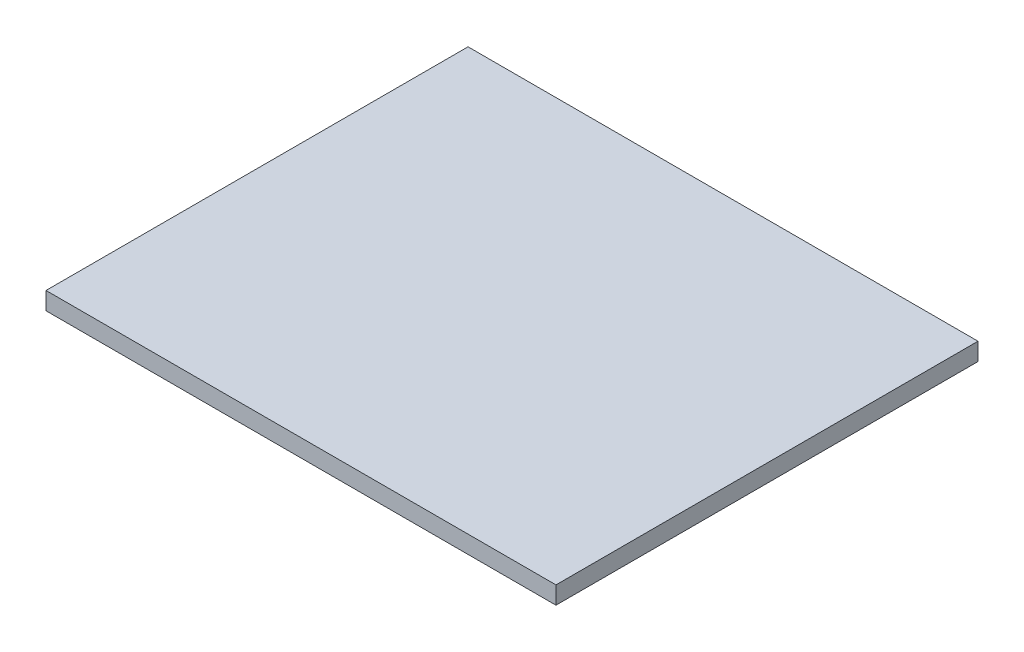
ISO-10303-21;
HEADER;
FILE_DESCRIPTION(('STEP AP214'),'2;1');
FILE_NAME('part.step','',(''),(''),'','','');
FILE_SCHEMA(('AUTOMOTIVE_DESIGN { 1 0 10303 214 1 1 1 1 }'));
ENDSEC;
DATA;
#1=APPLICATION_CONTEXT('core data for automotive mechanical design processes');
#2=APPLICATION_PROTOCOL_DEFINITION('international standard','automotive_design',2000,#1);
#3=PRODUCT_CONTEXT('',#1,'mechanical');
#4=PRODUCT('Part','Part','',(#3));
#5=PRODUCT_RELATED_PRODUCT_CATEGORY('part','',(#4));
#6=PRODUCT_DEFINITION_FORMATION('','',#4);
#7=PRODUCT_DEFINITION_CONTEXT('part definition',#1,'design');
#8=PRODUCT_DEFINITION('design','',#6,#7);
#9=PRODUCT_DEFINITION_SHAPE('','',#8);
#10=(LENGTH_UNIT() NAMED_UNIT(*) SI_UNIT(.MILLI.,.METRE.));
#11=(NAMED_UNIT(*) PLANE_ANGLE_UNIT() SI_UNIT($,.RADIAN.));
#12=(NAMED_UNIT(*) SI_UNIT($,.STERADIAN.) SOLID_ANGLE_UNIT());
#13=UNCERTAINTY_MEASURE_WITH_UNIT(LENGTH_MEASURE(1.E-05),#10,'distance_accuracy_value','');
#14=(GEOMETRIC_REPRESENTATION_CONTEXT(3) GLOBAL_UNCERTAINTY_ASSIGNED_CONTEXT((#13)) GLOBAL_UNIT_ASSIGNED_CONTEXT((#10,
#11,#12)) REPRESENTATION_CONTEXT('',''));
#15=CARTESIAN_POINT('',(0.,0.,0.));
#16=DIRECTION('',(0.,0.,1.));
#17=DIRECTION('',(1.,0.,0.));
#18=AXIS2_PLACEMENT_3D('',#15,#16,#17);
#19=CARTESIAN_POINT('',(29.000000372529,0.,23.9999995529652));
#20=DIRECTION('',(0.,0.,1.));
#21=DIRECTION('',(1.,0.,0.));
#22=AXIS2_PLACEMENT_3D('',#19,#20,#21);
#23=PLANE('',#22);
#24=DIRECTION('',(0.,1.,0.));
#25=VECTOR('',#24,1.);
#26=CARTESIAN_POINT('',(29.000000372529,0.,23.9999995529652));
#27=LINE('',#26,#25);
#28=CARTESIAN_POINT('',(29.000000372529,0.,23.9999995529652));
#29=VERTEX_POINT('',#28);
#30=CARTESIAN_POINT('',(29.000000372529,2.00199999990501,23.9999995529652));
#31=VERTEX_POINT('',#30);
#32=EDGE_CURVE('P0_E37',#29,#31,#27,.T.);
#33=ORIENTED_EDGE('',*,*,#32,.T.);
#34=DIRECTION('',(1.,0.,0.));
#35=VECTOR('',#34,1.);
#36=CARTESIAN_POINT('',(29.000000372529,2.00199999990501,23.9999995529652));
#37=LINE('',#36,#35);
#38=CARTESIAN_POINT('',(-29.000000372529,2.00199999990501,23.9999995529652));
#39=VERTEX_POINT('',#38);
#40=EDGE_CURVE('P0_E74',#39,#31,#37,.T.);
#41=ORIENTED_EDGE('',*,*,#40,.F.);
#42=DIRECTION('',(0.,1.,0.));
#43=VECTOR('',#42,1.);
#44=CARTESIAN_POINT('',(-29.000000372529,0.,23.9999995529652));
#45=LINE('',#44,#43);
#46=CARTESIAN_POINT('',(-29.000000372529,0.,23.9999995529652));
#47=VERTEX_POINT('',#46);
#48=EDGE_CURVE('P0_E11',#47,#39,#45,.T.);
#49=ORIENTED_EDGE('',*,*,#48,.F.);
#50=DIRECTION('',(1.,0.,0.));
#51=VECTOR('',#50,1.);
#52=CARTESIAN_POINT('',(29.000000372529,0.,23.9999995529652));
#53=LINE('',#52,#51);
#54=EDGE_CURVE('P0_E75',#47,#29,#53,.T.);
#55=ORIENTED_EDGE('',*,*,#54,.T.);
#56=EDGE_LOOP('',(#33,#41,#49,#55));
#57=FACE_BOUND('',#56,.T.);
#58=ADVANCED_FACE('P0_F34',(#57),#23,.T.);
#59=CARTESIAN_POINT('',(-29.000000372529,0.,23.9999995529652));
#60=DIRECTION('',(-1.,0.,0.));
#61=DIRECTION('',(0.,0.,1.));
#62=AXIS2_PLACEMENT_3D('',#59,#60,#61);
#63=PLANE('',#62);
#64=ORIENTED_EDGE('',*,*,#48,.T.);
#65=DIRECTION('',(0.,0.,1.));
#66=VECTOR('',#65,1.);
#67=CARTESIAN_POINT('',(-29.000000372529,2.00199999990501,23.9999995529652));
#68=LINE('',#67,#66);
#69=CARTESIAN_POINT('',(-29.000000372529,2.00199999990501,-23.9999995529652));
#70=VERTEX_POINT('',#69);
#71=EDGE_CURVE('P0_E91',#70,#39,#68,.T.);
#72=ORIENTED_EDGE('',*,*,#71,.F.);
#73=DIRECTION('',(0.,1.,0.));
#74=VECTOR('',#73,1.);
#75=CARTESIAN_POINT('',(-29.000000372529,0.,-23.9999995529652));
#76=LINE('',#75,#74);
#77=CARTESIAN_POINT('',(-29.000000372529,0.,-23.9999995529652));
#78=VERTEX_POINT('',#77);
#79=EDGE_CURVE('P0_E42',#78,#70,#76,.T.);
#80=ORIENTED_EDGE('',*,*,#79,.F.);
#81=DIRECTION('',(0.,0.,1.));
#82=VECTOR('',#81,1.);
#83=CARTESIAN_POINT('',(-29.000000372529,0.,23.9999995529652));
#84=LINE('',#83,#82);
#85=EDGE_CURVE('P0_E80',#78,#47,#84,.T.);
#86=ORIENTED_EDGE('',*,*,#85,.T.);
#87=EDGE_LOOP('',(#64,#72,#80,#86));
#88=FACE_BOUND('',#87,.T.);
#89=ADVANCED_FACE('P0_F106',(#88),#63,.T.);
#90=CARTESIAN_POINT('',(-29.000000372529,0.,-23.9999995529652));
#91=DIRECTION('',(0.,0.,-1.));
#92=DIRECTION('',(-1.,0.,0.));
#93=AXIS2_PLACEMENT_3D('',#90,#91,#92);
#94=PLANE('',#93);
#95=ORIENTED_EDGE('',*,*,#79,.T.);
#96=DIRECTION('',(-1.,0.,0.));
#97=VECTOR('',#96,1.);
#98=CARTESIAN_POINT('',(-29.000000372529,2.00199999990501,-23.9999995529652));
#99=LINE('',#98,#97);
#100=CARTESIAN_POINT('',(29.000000372529,2.00199999990501,-23.9999995529652));
#101=VERTEX_POINT('',#100);
#102=EDGE_CURVE('P0_E87',#101,#70,#99,.T.);
#103=ORIENTED_EDGE('',*,*,#102,.F.);
#104=DIRECTION('',(0.,1.,0.));
#105=VECTOR('',#104,1.);
#106=CARTESIAN_POINT('',(29.000000372529,0.,-23.9999995529652));
#107=LINE('',#106,#105);
#108=CARTESIAN_POINT('',(29.000000372529,0.,-23.9999995529652));
#109=VERTEX_POINT('',#108);
#110=EDGE_CURVE('P0_E79',#109,#101,#107,.T.);
#111=ORIENTED_EDGE('',*,*,#110,.F.);
#112=DIRECTION('',(-1.,0.,0.));
#113=VECTOR('',#112,1.);
#114=CARTESIAN_POINT('',(-29.000000372529,0.,-23.9999995529652));
#115=LINE('',#114,#113);
#116=EDGE_CURVE('P0_E99',#109,#78,#115,.T.);
#117=ORIENTED_EDGE('',*,*,#116,.T.);
#118=EDGE_LOOP('',(#95,#103,#111,#117));
#119=FACE_BOUND('',#118,.T.);
#120=ADVANCED_FACE('P0_F103',(#119),#94,.T.);
#121=CARTESIAN_POINT('',(29.000000372529,0.,-23.9999995529652));
#122=DIRECTION('',(1.,0.,0.));
#123=DIRECTION('',(0.,0.,-1.));
#124=AXIS2_PLACEMENT_3D('',#121,#122,#123);
#125=PLANE('',#124);
#126=ORIENTED_EDGE('',*,*,#110,.T.);
#127=DIRECTION('',(0.,0.,-1.));
#128=VECTOR('',#127,1.);
#129=CARTESIAN_POINT('',(29.000000372529,2.00199999990501,-23.9999995529652));
#130=LINE('',#129,#128);
#131=EDGE_CURVE('P0_E82',#31,#101,#130,.T.);
#132=ORIENTED_EDGE('',*,*,#131,.F.);
#133=ORIENTED_EDGE('',*,*,#32,.F.);
#134=DIRECTION('',(0.,0.,-1.));
#135=VECTOR('',#134,1.);
#136=CARTESIAN_POINT('',(29.000000372529,0.,-23.9999995529652));
#137=LINE('',#136,#135);
#138=EDGE_CURVE('P0_E97',#29,#109,#137,.T.);
#139=ORIENTED_EDGE('',*,*,#138,.T.);
#140=EDGE_LOOP('',(#126,#132,#133,#139));
#141=FACE_BOUND('',#140,.T.);
#142=ADVANCED_FACE('P0_F83',(#141),#125,.T.);
#143=CARTESIAN_POINT('',(0.,0.,0.));
#144=DIRECTION('',(0.,-1.,0.));
#145=DIRECTION('',(0.,0.,-1.));
#146=AXIS2_PLACEMENT_3D('',#143,#144,#145);
#147=PLANE('',#146);
#148=ORIENTED_EDGE('',*,*,#54,.F.);
#149=ORIENTED_EDGE('',*,*,#85,.F.);
#150=ORIENTED_EDGE('',*,*,#116,.F.);
#151=ORIENTED_EDGE('',*,*,#138,.F.);
#152=EDGE_LOOP('',(#148,#149,#150,#151));
#153=FACE_BOUND('',#152,.T.);
#154=ADVANCED_FACE('P0_F108',(#153),#147,.T.);
#155=CARTESIAN_POINT('',(0.,2.00199999990501,0.));
#156=DIRECTION('',(0.,-1.,0.));
#157=DIRECTION('',(0.,0.,-1.));
#158=AXIS2_PLACEMENT_3D('',#155,#156,#157);
#159=PLANE('',#158);
#160=ORIENTED_EDGE('',*,*,#40,.T.);
#161=ORIENTED_EDGE('',*,*,#131,.T.);
#162=ORIENTED_EDGE('',*,*,#102,.T.);
#163=ORIENTED_EDGE('',*,*,#71,.T.);
#164=EDGE_LOOP('',(#160,#161,#162,#163));
#165=FACE_BOUND('',#164,.T.);
#166=ADVANCED_FACE('P0_F90',(#165),#159,.F.);
#167=CLOSED_SHELL('',(#58,#89,#120,#142,#154,#166));
#168=MANIFOLD_SOLID_BREP('P0_B2',#167);
#169=CARTESIAN_POINT('',(-9.89949493661162,2.,-9.89949493661117));
#170=DIRECTION('',(0.,-1.,0.));
#171=DIRECTION('',(0.,0.,-1.));
#172=AXIS2_PLACEMENT_3D('',#169,#170,#171);
#173=CYLINDRICAL_SURFACE('',#172,1.7500000000006);
#174=DIRECTION('',(0.,-1.,0.));
#175=VECTOR('',#174,1.);
#176=CARTESIAN_POINT('',(-9.89949493661162,2.,-8.14949493661057));
#177=LINE('',#176,#175);
#178=CARTESIAN_POINT('',(-9.89949493661162,2.,-8.14949493661057));
#179=VERTEX_POINT('',#178);
#180=CARTESIAN_POINT('',(-9.89949493661162,0.,-8.14949493661057));
#181=VERTEX_POINT('',#180);
#182=EDGE_CURVE('P1_E341',#179,#181,#177,.T.);
#183=ORIENTED_EDGE('',*,*,#182,.F.);
#184=CARTESIAN_POINT('',(-9.89949493661162,2.,-9.89949493661117));
#185=DIRECTION('',(0.,1.,0.));
#186=DIRECTION('',(0.,0.,1.));
#187=AXIS2_PLACEMENT_3D('',#184,#185,#186);
#188=CIRCLE('',#187,1.7500000000006);
#189=CARTESIAN_POINT('',(-9.89949493661162,2.,-11.6494949366118));
#190=VERTEX_POINT('',#189);
#191=EDGE_CURVE('P1_E505',#179,#190,#188,.T.);
#192=ORIENTED_EDGE('',*,*,#191,.T.);
#193=DIRECTION('',(0.,-1.,0.));
#194=VECTOR('',#193,1.);
#195=CARTESIAN_POINT('',(-9.89949493661162,2.,-11.6494949366118));
#196=LINE('',#195,#194);
#197=CARTESIAN_POINT('',(-9.89949493661162,0.,-11.6494949366118));
#198=VERTEX_POINT('',#197);
#199=EDGE_CURVE('P1_E340',#190,#198,#196,.T.);
#200=ORIENTED_EDGE('',*,*,#199,.T.);
#201=CARTESIAN_POINT('',(-9.89949493661162,0.,-9.89949493661117));
#202=DIRECTION('',(0.,1.,0.));
#203=DIRECTION('',(0.,0.,1.));
#204=AXIS2_PLACEMENT_3D('',#201,#202,#203);
#205=CIRCLE('',#204,1.7500000000006);
#206=EDGE_CURVE('P1_E537',#181,#198,#205,.T.);
#207=ORIENTED_EDGE('',*,*,#206,.F.);
#208=EDGE_LOOP('',(#183,#192,#200,#207));
#209=FACE_BOUND('',#208,.T.);
#210=ADVANCED_FACE('P1_F17',(#209),#173,.F.);
#211=CARTESIAN_POINT('',(-9.89949493661117,2.,9.89949493661216));
#212=DIRECTION('',(0.,-1.,0.));
#213=DIRECTION('',(0.,0.,-1.));
#214=AXIS2_PLACEMENT_3D('',#211,#212,#213);
#215=CYLINDRICAL_SURFACE('',#214,1.75000000000041);
#216=DIRECTION('',(0.,-1.,0.));
#217=VECTOR('',#216,1.);
#218=CARTESIAN_POINT('',(-9.89949493661117,2.,11.6494949366126));
#219=LINE('',#218,#217);
#220=CARTESIAN_POINT('',(-9.89949493661117,2.,11.6494949366126));
#221=VERTEX_POINT('',#220);
#222=CARTESIAN_POINT('',(-9.89949493661117,0.,11.6494949366126));
#223=VERTEX_POINT('',#222);
#224=EDGE_CURVE('P1_E290',#221,#223,#219,.T.);
#225=ORIENTED_EDGE('',*,*,#224,.F.);
#226=CARTESIAN_POINT('',(-9.89949493661117,2.,9.89949493661216));
#227=DIRECTION('',(0.,1.,0.));
#228=DIRECTION('',(0.,0.,1.));
#229=AXIS2_PLACEMENT_3D('',#226,#227,#228);
#230=CIRCLE('',#229,1.75000000000041);
#231=CARTESIAN_POINT('',(-9.89949493661117,2.,8.14949493661176));
#232=VERTEX_POINT('',#231);
#233=EDGE_CURVE('P1_E502',#221,#232,#230,.T.);
#234=ORIENTED_EDGE('',*,*,#233,.T.);
#235=DIRECTION('',(0.,-1.,0.));
#236=VECTOR('',#235,1.);
#237=CARTESIAN_POINT('',(-9.89949493661117,2.,8.14949493661176));
#238=LINE('',#237,#236);
#239=CARTESIAN_POINT('',(-9.89949493661117,0.,8.14949493661176));
#240=VERTEX_POINT('',#239);
#241=EDGE_CURVE('P1_E437',#232,#240,#238,.T.);
#242=ORIENTED_EDGE('',*,*,#241,.T.);
#243=CARTESIAN_POINT('',(-9.89949493661117,0.,9.89949493661216));
#244=DIRECTION('',(0.,1.,0.));
#245=DIRECTION('',(0.,0.,1.));
#246=AXIS2_PLACEMENT_3D('',#243,#244,#245);
#247=CIRCLE('',#246,1.75000000000041);
#248=EDGE_CURVE('P1_E793',#223,#240,#247,.T.);
#249=ORIENTED_EDGE('',*,*,#248,.F.);
#250=EDGE_LOOP('',(#225,#234,#242,#249));
#251=FACE_BOUND('',#250,.T.);
#252=ADVANCED_FACE('P1_F575',(#251),#215,.F.);
#253=CARTESIAN_POINT('',(9.89949493661216,2.,9.89949493661172));
#254=DIRECTION('',(0.,-1.,0.));
#255=DIRECTION('',(0.,0.,-1.));
#256=AXIS2_PLACEMENT_3D('',#253,#254,#255);
#257=CYLINDRICAL_SURFACE('',#256,1.74999999999986);
#258=DIRECTION('',(0.,-1.,0.));
#259=VECTOR('',#258,1.);
#260=CARTESIAN_POINT('',(9.89949493661216,2.,11.6494949366116));
#261=LINE('',#260,#259);
#262=CARTESIAN_POINT('',(9.89949493661216,2.,11.6494949366116));
#263=VERTEX_POINT('',#262);
#264=CARTESIAN_POINT('',(9.89949493661216,0.,11.6494949366116));
#265=VERTEX_POINT('',#264);
#266=EDGE_CURVE('P1_E316',#263,#265,#261,.T.);
#267=ORIENTED_EDGE('',*,*,#266,.F.);
#268=CARTESIAN_POINT('',(9.89949493661216,2.,9.89949493661172));
#269=DIRECTION('',(0.,1.,0.));
#270=DIRECTION('',(0.,0.,1.));
#271=AXIS2_PLACEMENT_3D('',#268,#269,#270);
#272=CIRCLE('',#271,1.74999999999986);
#273=CARTESIAN_POINT('',(9.89949493661216,2.,8.14949493661186));
#274=VERTEX_POINT('',#273);
#275=EDGE_CURVE('P1_E277',#263,#274,#272,.T.);
#276=ORIENTED_EDGE('',*,*,#275,.T.);
#277=DIRECTION('',(0.,-1.,0.));
#278=VECTOR('',#277,1.);
#279=CARTESIAN_POINT('',(9.89949493661216,2.,8.14949493661186));
#280=LINE('',#279,#278);
#281=CARTESIAN_POINT('',(9.89949493661216,0.,8.14949493661186));
#282=VERTEX_POINT('',#281);
#283=EDGE_CURVE('P1_E328',#274,#282,#280,.T.);
#284=ORIENTED_EDGE('',*,*,#283,.T.);
#285=CARTESIAN_POINT('',(9.89949493661216,0.,9.89949493661172));
#286=DIRECTION('',(0.,1.,0.));
#287=DIRECTION('',(0.,0.,1.));
#288=AXIS2_PLACEMENT_3D('',#285,#286,#287);
#289=CIRCLE('',#288,1.74999999999986);
#290=EDGE_CURVE('P1_E253',#265,#282,#289,.T.);
#291=ORIENTED_EDGE('',*,*,#290,.F.);
#292=EDGE_LOOP('',(#267,#276,#284,#291));
#293=FACE_BOUND('',#292,.T.);
#294=ADVANCED_FACE('P1_F534',(#293),#257,.F.);
#295=CARTESIAN_POINT('',(-20.,2.,15.));
#296=DIRECTION('',(0.,-1.,0.));
#297=DIRECTION('',(0.,0.,-1.));
#298=AXIS2_PLACEMENT_3D('',#295,#296,#297);
#299=CYLINDRICAL_SURFACE('',#298,1.75);
#300=DIRECTION('',(0.,-1.,0.));
#301=VECTOR('',#300,1.);
#302=CARTESIAN_POINT('',(-20.,2.,16.75));
#303=LINE('',#302,#301);
#304=CARTESIAN_POINT('',(-20.,2.,16.75));
#305=VERTEX_POINT('',#304);
#306=CARTESIAN_POINT('',(-20.,0.,16.75));
#307=VERTEX_POINT('',#306);
#308=EDGE_CURVE('P1_E383',#305,#307,#303,.T.);
#309=ORIENTED_EDGE('',*,*,#308,.F.);
#310=CARTESIAN_POINT('',(-20.,2.,15.));
#311=DIRECTION('',(0.,1.,0.));
#312=DIRECTION('',(0.,0.,1.));
#313=AXIS2_PLACEMENT_3D('',#310,#311,#312);
#314=CIRCLE('',#313,1.75);
#315=CARTESIAN_POINT('',(-20.,2.,13.25));
#316=VERTEX_POINT('',#315);
#317=EDGE_CURVE('P1_E499',#305,#316,#314,.T.);
#318=ORIENTED_EDGE('',*,*,#317,.T.);
#319=DIRECTION('',(0.,-1.,0.));
#320=VECTOR('',#319,1.);
#321=CARTESIAN_POINT('',(-20.,2.,13.25));
#322=LINE('',#321,#320);
#323=CARTESIAN_POINT('',(-20.,0.,13.25));
#324=VERTEX_POINT('',#323);
#325=EDGE_CURVE('P1_E398',#316,#324,#322,.T.);
#326=ORIENTED_EDGE('',*,*,#325,.T.);
#327=CARTESIAN_POINT('',(-20.,0.,15.));
#328=DIRECTION('',(0.,1.,0.));
#329=DIRECTION('',(0.,0.,1.));
#330=AXIS2_PLACEMENT_3D('',#327,#328,#329);
#331=CIRCLE('',#330,1.75);
#332=EDGE_CURVE('P1_E21',#307,#324,#331,.T.);
#333=ORIENTED_EDGE('',*,*,#332,.F.);
#334=EDGE_LOOP('',(#309,#318,#326,#333));
#335=FACE_BOUND('',#334,.T.);
#336=ADVANCED_FACE('P1_F574',(#335),#299,.F.);
#337=CARTESIAN_POINT('',(-20.,2.,-15.));
#338=DIRECTION('',(0.,-1.,0.));
#339=DIRECTION('',(0.,0.,-1.));
#340=AXIS2_PLACEMENT_3D('',#337,#338,#339);
#341=CYLINDRICAL_SURFACE('',#340,1.75);
#342=DIRECTION('',(0.,-1.,0.));
#343=VECTOR('',#342,1.);
#344=CARTESIAN_POINT('',(-20.,2.,-13.25));
#345=LINE('',#344,#343);
#346=CARTESIAN_POINT('',(-20.,2.,-13.25));
#347=VERTEX_POINT('',#346);
#348=CARTESIAN_POINT('',(-20.,0.,-13.25));
#349=VERTEX_POINT('',#348);
#350=EDGE_CURVE('P1_E389',#347,#349,#345,.T.);
#351=ORIENTED_EDGE('',*,*,#350,.F.);
#352=CARTESIAN_POINT('',(-20.,2.,-15.));
#353=DIRECTION('',(0.,1.,0.));
#354=DIRECTION('',(0.,0.,1.));
#355=AXIS2_PLACEMENT_3D('',#352,#353,#354);
#356=CIRCLE('',#355,1.75);
#357=CARTESIAN_POINT('',(-20.,2.,-16.75));
#358=VERTEX_POINT('',#357);
#359=EDGE_CURVE('P1_E457',#347,#358,#356,.T.);
#360=ORIENTED_EDGE('',*,*,#359,.T.);
#361=DIRECTION('',(0.,-1.,0.));
#362=VECTOR('',#361,1.);
#363=CARTESIAN_POINT('',(-20.,2.,-16.75));
#364=LINE('',#363,#362);
#365=CARTESIAN_POINT('',(-20.,0.,-16.75));
#366=VERTEX_POINT('',#365);
#367=EDGE_CURVE('P1_E410',#358,#366,#364,.T.);
#368=ORIENTED_EDGE('',*,*,#367,.T.);
#369=CARTESIAN_POINT('',(-20.,0.,-15.));
#370=DIRECTION('',(0.,1.,0.));
#371=DIRECTION('',(0.,0.,1.));
#372=AXIS2_PLACEMENT_3D('',#369,#370,#371);
#373=CIRCLE('',#372,1.75);
#374=EDGE_CURVE('P1_E411',#349,#366,#373,.T.);
#375=ORIENTED_EDGE('',*,*,#374,.F.);
#376=EDGE_LOOP('',(#351,#360,#368,#375));
#377=FACE_BOUND('',#376,.T.);
#378=ADVANCED_FACE('P1_F625',(#377),#341,.F.);
#379=CARTESIAN_POINT('',(9.89949493661172,2.,-9.89949493661161));
#380=DIRECTION('',(0.,-1.,0.));
#381=DIRECTION('',(0.,0.,-1.));
#382=AXIS2_PLACEMENT_3D('',#379,#380,#381);
#383=CYLINDRICAL_SURFACE('',#382,1.75);
#384=DIRECTION('',(0.,-1.,0.));
#385=VECTOR('',#384,1.);
#386=CARTESIAN_POINT('',(9.89949493661172,2.,-8.14949493661162));
#387=LINE('',#386,#385);
#388=CARTESIAN_POINT('',(9.89949493661172,2.,-8.14949493661161));
#389=VERTEX_POINT('',#388);
#390=CARTESIAN_POINT('',(9.89949493661172,0.,-8.14949493661161));
#391=VERTEX_POINT('',#390);
#392=EDGE_CURVE('P1_E360',#389,#391,#387,.T.);
#393=ORIENTED_EDGE('',*,*,#392,.F.);
#394=CARTESIAN_POINT('',(9.89949493661172,2.,-9.89949493661161));
#395=DIRECTION('',(0.,1.,0.));
#396=DIRECTION('',(0.,0.,1.));
#397=AXIS2_PLACEMENT_3D('',#394,#395,#396);
#398=CIRCLE('',#397,1.75);
#399=CARTESIAN_POINT('',(9.89949493661172,2.,-11.6494949366116));
#400=VERTEX_POINT('',#399);
#401=EDGE_CURVE('P1_E454',#389,#400,#398,.T.);
#402=ORIENTED_EDGE('',*,*,#401,.T.);
#403=DIRECTION('',(0.,-1.,0.));
#404=VECTOR('',#403,1.);
#405=CARTESIAN_POINT('',(9.89949493661172,2.,-11.6494949366116));
#406=LINE('',#405,#404);
#407=CARTESIAN_POINT('',(9.89949493661172,0.,-11.6494949366116));
#408=VERTEX_POINT('',#407);
#409=EDGE_CURVE('P1_E375',#400,#408,#406,.T.);
#410=ORIENTED_EDGE('',*,*,#409,.T.);
#411=CARTESIAN_POINT('',(9.89949493661172,0.,-9.89949493661161));
#412=DIRECTION('',(0.,1.,0.));
#413=DIRECTION('',(0.,0.,1.));
#414=AXIS2_PLACEMENT_3D('',#411,#412,#413);
#415=CIRCLE('',#414,1.75);
#416=EDGE_CURVE('P1_E293',#391,#408,#415,.T.);
#417=ORIENTED_EDGE('',*,*,#416,.F.);
#418=EDGE_LOOP('',(#393,#402,#410,#417));
#419=FACE_BOUND('',#418,.T.);
#420=ADVANCED_FACE('P1_F630',(#419),#383,.F.);
#421=CARTESIAN_POINT('',(20.,2.,15.));
#422=DIRECTION('',(0.,-1.,0.));
#423=DIRECTION('',(0.,0.,-1.));
#424=AXIS2_PLACEMENT_3D('',#421,#422,#423);
#425=CYLINDRICAL_SURFACE('',#424,1.75);
#426=DIRECTION('',(0.,-1.,0.));
#427=VECTOR('',#426,1.);
#428=CARTESIAN_POINT('',(20.,2.,16.75));
#429=LINE('',#428,#427);
#430=CARTESIAN_POINT('',(20.,2.,16.75));
#431=VERTEX_POINT('',#430);
#432=CARTESIAN_POINT('',(20.,0.,16.75));
#433=VERTEX_POINT('',#432);
#434=EDGE_CURVE('P1_E804',#431,#433,#429,.T.);
#435=ORIENTED_EDGE('',*,*,#434,.F.);
#436=CARTESIAN_POINT('',(20.,2.,15.));
#437=DIRECTION('',(0.,1.,0.));
#438=DIRECTION('',(0.,0.,1.));
#439=AXIS2_PLACEMENT_3D('',#436,#437,#438);
#440=CIRCLE('',#439,1.75);
#441=CARTESIAN_POINT('',(20.,2.,13.25));
#442=VERTEX_POINT('',#441);
#443=EDGE_CURVE('P1_E224',#431,#442,#440,.T.);
#444=ORIENTED_EDGE('',*,*,#443,.T.);
#445=DIRECTION('',(0.,-1.,0.));
#446=VECTOR('',#445,1.);
#447=CARTESIAN_POINT('',(20.,2.,13.25));
#448=LINE('',#447,#446);
#449=CARTESIAN_POINT('',(20.,0.,13.25));
#450=VERTEX_POINT('',#449);
#451=EDGE_CURVE('P1_E238',#442,#450,#448,.T.);
#452=ORIENTED_EDGE('',*,*,#451,.T.);
#453=CARTESIAN_POINT('',(20.,0.,15.));
#454=DIRECTION('',(0.,1.,0.));
#455=DIRECTION('',(0.,0.,1.));
#456=AXIS2_PLACEMENT_3D('',#453,#454,#455);
#457=CIRCLE('',#456,1.75);
#458=EDGE_CURVE('P1_E269',#433,#450,#457,.T.);
#459=ORIENTED_EDGE('',*,*,#458,.F.);
#460=EDGE_LOOP('',(#435,#444,#452,#459));
#461=FACE_BOUND('',#460,.T.);
#462=ADVANCED_FACE('P1_F549',(#461),#425,.F.);
#463=CARTESIAN_POINT('',(20.,2.,-15.));
#464=DIRECTION('',(0.,-1.,0.));
#465=DIRECTION('',(0.,0.,-1.));
#466=AXIS2_PLACEMENT_3D('',#463,#464,#465);
#467=CYLINDRICAL_SURFACE('',#466,1.75);
#468=DIRECTION('',(0.,-1.,0.));
#469=VECTOR('',#468,1.);
#470=CARTESIAN_POINT('',(20.,2.,-13.25));
#471=LINE('',#470,#469);
#472=CARTESIAN_POINT('',(20.,2.,-13.25));
#473=VERTEX_POINT('',#472);
#474=CARTESIAN_POINT('',(20.,0.,-13.25));
#475=VERTEX_POINT('',#474);
#476=EDGE_CURVE('P1_E219',#473,#475,#471,.T.);
#477=ORIENTED_EDGE('',*,*,#476,.F.);
#478=CARTESIAN_POINT('',(20.,2.,-15.));
#479=DIRECTION('',(0.,1.,0.));
#480=DIRECTION('',(0.,0.,1.));
#481=AXIS2_PLACEMENT_3D('',#478,#479,#480);
#482=CIRCLE('',#481,1.75);
#483=CARTESIAN_POINT('',(20.,2.,-16.75));
#484=VERTEX_POINT('',#483);
#485=EDGE_CURVE('P1_E213',#473,#484,#482,.T.);
#486=ORIENTED_EDGE('',*,*,#485,.T.);
#487=DIRECTION('',(0.,-1.,0.));
#488=VECTOR('',#487,1.);
#489=CARTESIAN_POINT('',(20.,2.,-16.75));
#490=LINE('',#489,#488);
#491=CARTESIAN_POINT('',(20.,0.,-16.75));
#492=VERTEX_POINT('',#491);
#493=EDGE_CURVE('P1_E216',#484,#492,#490,.T.);
#494=ORIENTED_EDGE('',*,*,#493,.T.);
#495=CARTESIAN_POINT('',(20.,0.,-15.));
#496=DIRECTION('',(0.,1.,0.));
#497=DIRECTION('',(0.,0.,1.));
#498=AXIS2_PLACEMENT_3D('',#495,#496,#497);
#499=CIRCLE('',#498,1.75);
#500=EDGE_CURVE('P1_E296',#475,#492,#499,.T.);
#501=ORIENTED_EDGE('',*,*,#500,.F.);
#502=EDGE_LOOP('',(#477,#486,#494,#501));
#503=FACE_BOUND('',#502,.T.);
#504=ADVANCED_FACE('P1_F215',(#503),#467,.F.);
#505=CARTESIAN_POINT('',(0.,2.,0.));
#506=DIRECTION('',(0.,-1.,0.));
#507=DIRECTION('',(0.,0.,-1.));
#508=AXIS2_PLACEMENT_3D('',#505,#506,#507);
#509=CYLINDRICAL_SURFACE('',#508,11.);
#510=DIRECTION('',(0.,-1.,0.));
#511=VECTOR('',#510,1.);
#512=CARTESIAN_POINT('',(0.,2.,11.));
#513=LINE('',#512,#511);
#514=CARTESIAN_POINT('',(0.,2.,11.));
#515=VERTEX_POINT('',#514);
#516=CARTESIAN_POINT('',(0.,0.,11.));
#517=VERTEX_POINT('',#516);
#518=EDGE_CURVE('P1_E424',#515,#517,#513,.T.);
#519=ORIENTED_EDGE('',*,*,#518,.F.);
#520=CARTESIAN_POINT('',(0.,2.,0.));
#521=DIRECTION('',(0.,1.,0.));
#522=DIRECTION('',(0.,0.,1.));
#523=AXIS2_PLACEMENT_3D('',#520,#521,#522);
#524=CIRCLE('',#523,11.);
#525=CARTESIAN_POINT('',(0.,2.,-11.));
#526=VERTEX_POINT('',#525);
#527=EDGE_CURVE('P1_E225',#515,#526,#524,.T.);
#528=ORIENTED_EDGE('',*,*,#527,.T.);
#529=DIRECTION('',(0.,-1.,0.));
#530=VECTOR('',#529,1.);
#531=CARTESIAN_POINT('',(0.,2.,-11.));
#532=LINE('',#531,#530);
#533=CARTESIAN_POINT('',(0.,0.,-11.));
#534=VERTEX_POINT('',#533);
#535=EDGE_CURVE('P1_E471',#526,#534,#532,.T.);
#536=ORIENTED_EDGE('',*,*,#535,.T.);
#537=CARTESIAN_POINT('',(0.,0.,0.));
#538=DIRECTION('',(0.,1.,0.));
#539=DIRECTION('',(0.,0.,1.));
#540=AXIS2_PLACEMENT_3D('',#537,#538,#539);
#541=CIRCLE('',#540,11.);
#542=EDGE_CURVE('P1_E313',#517,#534,#541,.T.);
#543=ORIENTED_EDGE('',*,*,#542,.F.);
#544=EDGE_LOOP('',(#519,#528,#536,#543));
#545=FACE_BOUND('',#544,.T.);
#546=ADVANCED_FACE('P1_F476',(#545),#509,.F.);
#547=CARTESIAN_POINT('',(25.,2.,-20.));
#548=DIRECTION('',(0.,0.,1.));
#549=DIRECTION('',(1.,0.,0.));
#550=AXIS2_PLACEMENT_3D('',#547,#548,#549);
#551=PLANE('',#550);
#552=DIRECTION('',(-1.,0.,0.));
#553=VECTOR('',#552,1.);
#554=CARTESIAN_POINT('',(25.,0.,-20.));
#555=LINE('',#554,#553);
#556=CARTESIAN_POINT('',(25.,0.,-20.));
#557=VERTEX_POINT('',#556);
#558=CARTESIAN_POINT('',(-25.,0.,-20.));
#559=VERTEX_POINT('',#558);
#560=EDGE_CURVE('P1_E283',#557,#559,#555,.T.);
#561=ORIENTED_EDGE('',*,*,#560,.T.);
#562=DIRECTION('',(0.,-1.,0.));
#563=VECTOR('',#562,1.);
#564=CARTESIAN_POINT('',(-25.,2.,-20.));
#565=LINE('',#564,#563);
#566=CARTESIAN_POINT('',(-25.,2.,-20.));
#567=VERTEX_POINT('',#566);
#568=EDGE_CURVE('P1_E272',#567,#559,#565,.T.);
#569=ORIENTED_EDGE('',*,*,#568,.F.);
#570=DIRECTION('',(-1.,0.,0.));
#571=VECTOR('',#570,1.);
#572=CARTESIAN_POINT('',(25.,2.,-20.));
#573=LINE('',#572,#571);
#574=CARTESIAN_POINT('',(25.,2.,-20.));
#575=VERTEX_POINT('',#574);
#576=EDGE_CURVE('P1_E475',#575,#567,#573,.T.);
#577=ORIENTED_EDGE('',*,*,#576,.F.);
#578=DIRECTION('',(0.,-1.,0.));
#579=VECTOR('',#578,1.);
#580=CARTESIAN_POINT('',(25.,2.,-20.));
#581=LINE('',#580,#579);
#582=EDGE_CURVE('P1_E10',#575,#557,#581,.T.);
#583=ORIENTED_EDGE('',*,*,#582,.T.);
#584=EDGE_LOOP('',(#561,#569,#577,#583));
#585=FACE_BOUND('',#584,.T.);
#586=ADVANCED_FACE('P1_F667',(#585),#551,.F.);
#587=CARTESIAN_POINT('',(25.,2.,-20.));
#588=DIRECTION('',(-1.,0.,0.));
#589=DIRECTION('',(0.,1.,0.));
#590=AXIS2_PLACEMENT_3D('',#587,#588,#589);
#591=PLANE('',#590);
#592=DIRECTION('',(0.,0.,-1.));
#593=VECTOR('',#592,1.);
#594=CARTESIAN_POINT('',(25.,0.,-20.));
#595=LINE('',#594,#593);
#596=CARTESIAN_POINT('',(25.,0.,20.));
#597=VERTEX_POINT('',#596);
#598=EDGE_CURVE('P1_E288',#597,#557,#595,.T.);
#599=ORIENTED_EDGE('',*,*,#598,.T.);
#600=ORIENTED_EDGE('',*,*,#582,.F.);
#601=DIRECTION('',(0.,0.,-1.));
#602=VECTOR('',#601,1.);
#603=CARTESIAN_POINT('',(25.,2.,-20.));
#604=LINE('',#603,#602);
#605=CARTESIAN_POINT('',(25.,2.,20.));
#606=VERTEX_POINT('',#605);
#607=EDGE_CURVE('P1_E881',#606,#575,#604,.T.);
#608=ORIENTED_EDGE('',*,*,#607,.F.);
#609=DIRECTION('',(0.,-1.,0.));
#610=VECTOR('',#609,1.);
#611=CARTESIAN_POINT('',(25.,2.,20.));
#612=LINE('',#611,#610);
#613=EDGE_CURVE('P1_E29',#606,#597,#612,.T.);
#614=ORIENTED_EDGE('',*,*,#613,.T.);
#615=EDGE_LOOP('',(#599,#600,#608,#614));
#616=FACE_BOUND('',#615,.T.);
#617=ADVANCED_FACE('P1_F675',(#616),#591,.F.);
#618=CARTESIAN_POINT('',(25.,2.,20.));
#619=DIRECTION('',(0.,0.,-1.));
#620=DIRECTION('',(-1.,0.,0.));
#621=AXIS2_PLACEMENT_3D('',#618,#619,#620);
#622=PLANE('',#621);
#623=DIRECTION('',(1.,0.,0.));
#624=VECTOR('',#623,1.);
#625=CARTESIAN_POINT('',(25.,0.,20.));
#626=LINE('',#625,#624);
#627=CARTESIAN_POINT('',(-25.,0.,20.));
#628=VERTEX_POINT('',#627);
#629=EDGE_CURVE('P1_E796',#628,#597,#626,.T.);
#630=ORIENTED_EDGE('',*,*,#629,.T.);
#631=ORIENTED_EDGE('',*,*,#613,.F.);
#632=DIRECTION('',(1.,0.,0.));
#633=VECTOR('',#632,1.);
#634=CARTESIAN_POINT('',(25.,2.,20.));
#635=LINE('',#634,#633);
#636=CARTESIAN_POINT('',(-25.,2.,20.));
#637=VERTEX_POINT('',#636);
#638=EDGE_CURVE('P1_E342',#637,#606,#635,.T.);
#639=ORIENTED_EDGE('',*,*,#638,.F.);
#640=DIRECTION('',(0.,-1.,0.));
#641=VECTOR('',#640,1.);
#642=CARTESIAN_POINT('',(-25.,2.,20.));
#643=LINE('',#642,#641);
#644=EDGE_CURVE('P1_E276',#637,#628,#643,.T.);
#645=ORIENTED_EDGE('',*,*,#644,.T.);
#646=EDGE_LOOP('',(#630,#631,#639,#645));
#647=FACE_BOUND('',#646,.T.);
#648=ADVANCED_FACE('P1_F684',(#647),#622,.F.);
#649=CARTESIAN_POINT('',(-25.,2.,-20.));
#650=DIRECTION('',(1.,0.,0.));
#651=DIRECTION('',(0.,0.,-1.));
#652=AXIS2_PLACEMENT_3D('',#649,#650,#651);
#653=PLANE('',#652);
#654=DIRECTION('',(0.,0.,1.));
#655=VECTOR('',#654,1.);
#656=CARTESIAN_POINT('',(-25.,0.,-20.));
#657=LINE('',#656,#655);
#658=EDGE_CURVE('P1_E289',#559,#628,#657,.T.);
#659=ORIENTED_EDGE('',*,*,#658,.T.);
#660=ORIENTED_EDGE('',*,*,#644,.F.);
#661=DIRECTION('',(0.,0.,1.));
#662=VECTOR('',#661,1.);
#663=CARTESIAN_POINT('',(-25.,2.,-20.));
#664=LINE('',#663,#662);
#665=EDGE_CURVE('P1_E490',#567,#637,#664,.T.);
#666=ORIENTED_EDGE('',*,*,#665,.F.);
#667=ORIENTED_EDGE('',*,*,#568,.T.);
#668=EDGE_LOOP('',(#659,#660,#666,#667));
#669=FACE_BOUND('',#668,.T.);
#670=ADVANCED_FACE('P1_F692',(#669),#653,.F.);
#671=CARTESIAN_POINT('',(0.,0.,0.));
#672=DIRECTION('',(0.,-1.,0.));
#673=DIRECTION('',(0.,0.,-1.));
#674=AXIS2_PLACEMENT_3D('',#671,#672,#673);
#675=PLANE('',#674);
#676=CARTESIAN_POINT('',(-9.89949493661162,0.,-9.89949493661117));
#677=DIRECTION('',(0.,1.,0.));
#678=DIRECTION('',(0.,0.,1.));
#679=AXIS2_PLACEMENT_3D('',#676,#677,#678);
#680=CIRCLE('',#679,1.7500000000006);
#681=EDGE_CURVE('P1_E336',#198,#181,#680,.T.);
#682=ORIENTED_EDGE('',*,*,#681,.T.);
#683=ORIENTED_EDGE('',*,*,#206,.T.);
#684=EDGE_LOOP('',(#682,#683));
#685=FACE_BOUND('',#684,.T.);
#686=CARTESIAN_POINT('',(9.89949493661216,0.,9.89949493661172));
#687=DIRECTION('',(0.,1.,0.));
#688=DIRECTION('',(0.,0.,1.));
#689=AXIS2_PLACEMENT_3D('',#686,#687,#688);
#690=CIRCLE('',#689,1.74999999999986);
#691=EDGE_CURVE('P1_E320',#282,#265,#690,.T.);
#692=ORIENTED_EDGE('',*,*,#691,.T.);
#693=ORIENTED_EDGE('',*,*,#290,.T.);
#694=EDGE_LOOP('',(#692,#693));
#695=FACE_BOUND('',#694,.T.);
#696=CARTESIAN_POINT('',(-20.,0.,-15.));
#697=DIRECTION('',(0.,1.,0.));
#698=DIRECTION('',(0.,0.,1.));
#699=AXIS2_PLACEMENT_3D('',#696,#697,#698);
#700=CIRCLE('',#699,1.75);
#701=EDGE_CURVE('P1_E438',#366,#349,#700,.T.);
#702=ORIENTED_EDGE('',*,*,#701,.T.);
#703=ORIENTED_EDGE('',*,*,#374,.T.);
#704=EDGE_LOOP('',(#702,#703));
#705=FACE_BOUND('',#704,.T.);
#706=CARTESIAN_POINT('',(20.,0.,15.));
#707=DIRECTION('',(0.,1.,0.));
#708=DIRECTION('',(0.,0.,1.));
#709=AXIS2_PLACEMENT_3D('',#706,#707,#708);
#710=CIRCLE('',#709,1.75);
#711=EDGE_CURVE('P1_E248',#450,#433,#710,.T.);
#712=ORIENTED_EDGE('',*,*,#711,.T.);
#713=ORIENTED_EDGE('',*,*,#458,.T.);
#714=EDGE_LOOP('',(#712,#713));
#715=FACE_BOUND('',#714,.T.);
#716=CARTESIAN_POINT('',(0.,0.,0.));
#717=DIRECTION('',(0.,1.,0.));
#718=DIRECTION('',(0.,0.,1.));
#719=AXIS2_PLACEMENT_3D('',#716,#717,#718);
#720=CIRCLE('',#719,11.);
#721=EDGE_CURVE('P1_E430',#534,#517,#720,.T.);
#722=ORIENTED_EDGE('',*,*,#721,.T.);
#723=ORIENTED_EDGE('',*,*,#542,.T.);
#724=EDGE_LOOP('',(#722,#723));
#725=FACE_BOUND('',#724,.T.);
#726=CARTESIAN_POINT('',(20.,0.,-15.));
#727=DIRECTION('',(0.,1.,0.));
#728=DIRECTION('',(0.,0.,1.));
#729=AXIS2_PLACEMENT_3D('',#726,#727,#728);
#730=CIRCLE('',#729,1.75);
#731=EDGE_CURVE('P1_E231',#492,#475,#730,.T.);
#732=ORIENTED_EDGE('',*,*,#731,.T.);
#733=ORIENTED_EDGE('',*,*,#500,.T.);
#734=EDGE_LOOP('',(#732,#733));
#735=FACE_BOUND('',#734,.T.);
#736=CARTESIAN_POINT('',(9.89949493661172,0.,-9.89949493661161));
#737=DIRECTION('',(0.,1.,0.));
#738=DIRECTION('',(0.,0.,1.));
#739=AXIS2_PLACEMENT_3D('',#736,#737,#738);
#740=CIRCLE('',#739,1.75);
#741=EDGE_CURVE('P1_E365',#408,#391,#740,.T.);
#742=ORIENTED_EDGE('',*,*,#741,.T.);
#743=ORIENTED_EDGE('',*,*,#416,.T.);
#744=EDGE_LOOP('',(#742,#743));
#745=FACE_BOUND('',#744,.T.);
#746=CARTESIAN_POINT('',(-20.,0.,15.));
#747=DIRECTION('',(0.,1.,0.));
#748=DIRECTION('',(0.,0.,1.));
#749=AXIS2_PLACEMENT_3D('',#746,#747,#748);
#750=CIRCLE('',#749,1.75);
#751=EDGE_CURVE('P1_E388',#324,#307,#750,.T.);
#752=ORIENTED_EDGE('',*,*,#751,.T.);
#753=ORIENTED_EDGE('',*,*,#332,.T.);
#754=EDGE_LOOP('',(#752,#753));
#755=FACE_BOUND('',#754,.T.);
#756=CARTESIAN_POINT('',(-9.89949493661117,0.,9.89949493661216));
#757=DIRECTION('',(0.,1.,0.));
#758=DIRECTION('',(0.,0.,1.));
#759=AXIS2_PLACEMENT_3D('',#756,#757,#758);
#760=CIRCLE('',#759,1.75000000000041);
#761=EDGE_CURVE('P1_E433',#240,#223,#760,.T.);
#762=ORIENTED_EDGE('',*,*,#761,.T.);
#763=ORIENTED_EDGE('',*,*,#248,.T.);
#764=EDGE_LOOP('',(#762,#763));
#765=FACE_BOUND('',#764,.T.);
#766=ORIENTED_EDGE('',*,*,#658,.F.);
#767=ORIENTED_EDGE('',*,*,#560,.F.);
#768=ORIENTED_EDGE('',*,*,#598,.F.);
#769=ORIENTED_EDGE('',*,*,#629,.F.);
#770=EDGE_LOOP('',(#766,#767,#768,#769));
#771=FACE_BOUND('',#770,.T.);
#772=ADVANCED_FACE('P1_F481',(#685,#695,#705,#715,#725,#735,#745,#755,#765,#771),#675,.T.);
#773=CARTESIAN_POINT('',(0.,2.,0.));
#774=DIRECTION('',(0.,-1.,0.));
#775=DIRECTION('',(0.,0.,-1.));
#776=AXIS2_PLACEMENT_3D('',#773,#774,#775);
#777=PLANE('',#776);
#778=CARTESIAN_POINT('',(-9.89949493661162,2.,-9.89949493661117));
#779=DIRECTION('',(0.,1.,0.));
#780=DIRECTION('',(0.,0.,1.));
#781=AXIS2_PLACEMENT_3D('',#778,#779,#780);
#782=CIRCLE('',#781,1.7500000000006);
#783=EDGE_CURVE('P1_E352',#190,#179,#782,.T.);
#784=ORIENTED_EDGE('',*,*,#783,.F.);
#785=ORIENTED_EDGE('',*,*,#191,.F.);
#786=EDGE_LOOP('',(#784,#785));
#787=FACE_BOUND('',#786,.T.);
#788=CARTESIAN_POINT('',(-9.89949493661117,2.,9.89949493661216));
#789=DIRECTION('',(0.,1.,0.));
#790=DIRECTION('',(0.,0.,1.));
#791=AXIS2_PLACEMENT_3D('',#788,#789,#790);
#792=CIRCLE('',#791,1.75000000000041);
#793=EDGE_CURVE('P1_E447',#232,#221,#792,.T.);
#794=ORIENTED_EDGE('',*,*,#793,.F.);
#795=ORIENTED_EDGE('',*,*,#233,.F.);
#796=EDGE_LOOP('',(#794,#795));
#797=FACE_BOUND('',#796,.T.);
#798=CARTESIAN_POINT('',(9.89949493661216,2.,9.89949493661172));
#799=DIRECTION('',(0.,1.,0.));
#800=DIRECTION('',(0.,0.,1.));
#801=AXIS2_PLACEMENT_3D('',#798,#799,#800);
#802=CIRCLE('',#801,1.74999999999986);
#803=EDGE_CURVE('P1_E256',#274,#263,#802,.T.);
#804=ORIENTED_EDGE('',*,*,#803,.F.);
#805=ORIENTED_EDGE('',*,*,#275,.F.);
#806=EDGE_LOOP('',(#804,#805));
#807=FACE_BOUND('',#806,.T.);
#808=CARTESIAN_POINT('',(-20.,2.,15.));
#809=DIRECTION('',(0.,1.,0.));
#810=DIRECTION('',(0.,0.,1.));
#811=AXIS2_PLACEMENT_3D('',#808,#809,#810);
#812=CIRCLE('',#811,1.75);
#813=EDGE_CURVE('P1_E333',#316,#305,#812,.T.);
#814=ORIENTED_EDGE('',*,*,#813,.F.);
#815=ORIENTED_EDGE('',*,*,#317,.F.);
#816=EDGE_LOOP('',(#814,#815));
#817=FACE_BOUND('',#816,.T.);
#818=CARTESIAN_POINT('',(-20.,2.,-15.));
#819=DIRECTION('',(0.,1.,0.));
#820=DIRECTION('',(0.,0.,1.));
#821=AXIS2_PLACEMENT_3D('',#818,#819,#820);
#822=CIRCLE('',#821,1.75);
#823=EDGE_CURVE('P1_E403',#358,#347,#822,.T.);
#824=ORIENTED_EDGE('',*,*,#823,.F.);
#825=ORIENTED_EDGE('',*,*,#359,.F.);
#826=EDGE_LOOP('',(#824,#825));
#827=FACE_BOUND('',#826,.T.);
#828=CARTESIAN_POINT('',(9.89949493661172,2.,-9.89949493661161));
#829=DIRECTION('',(0.,1.,0.));
#830=DIRECTION('',(0.,0.,1.));
#831=AXIS2_PLACEMENT_3D('',#828,#829,#830);
#832=CIRCLE('',#831,1.75);
#833=EDGE_CURVE('P1_E366',#400,#389,#832,.T.);
#834=ORIENTED_EDGE('',*,*,#833,.F.);
#835=ORIENTED_EDGE('',*,*,#401,.F.);
#836=EDGE_LOOP('',(#834,#835));
#837=FACE_BOUND('',#836,.T.);
#838=CARTESIAN_POINT('',(20.,2.,15.));
#839=DIRECTION('',(0.,1.,0.));
#840=DIRECTION('',(0.,0.,1.));
#841=AXIS2_PLACEMENT_3D('',#838,#839,#840);
#842=CIRCLE('',#841,1.75);
#843=EDGE_CURVE('P1_E381',#442,#431,#842,.T.);
#844=ORIENTED_EDGE('',*,*,#843,.F.);
#845=ORIENTED_EDGE('',*,*,#443,.F.);
#846=EDGE_LOOP('',(#844,#845));
#847=FACE_BOUND('',#846,.T.);
#848=CARTESIAN_POINT('',(20.,2.,-15.));
#849=DIRECTION('',(0.,1.,0.));
#850=DIRECTION('',(0.,0.,1.));
#851=AXIS2_PLACEMENT_3D('',#848,#849,#850);
#852=CIRCLE('',#851,1.75);
#853=EDGE_CURVE('P1_E229',#484,#473,#852,.T.);
#854=ORIENTED_EDGE('',*,*,#853,.F.);
#855=ORIENTED_EDGE('',*,*,#485,.F.);
#856=EDGE_LOOP('',(#854,#855));
#857=FACE_BOUND('',#856,.T.);
#858=CARTESIAN_POINT('',(0.,2.,0.));
#859=DIRECTION('',(0.,1.,0.));
#860=DIRECTION('',(0.,0.,1.));
#861=AXIS2_PLACEMENT_3D('',#858,#859,#860);
#862=CIRCLE('',#861,11.);
#863=EDGE_CURVE('P1_E233',#526,#515,#862,.T.);
#864=ORIENTED_EDGE('',*,*,#863,.F.);
#865=ORIENTED_EDGE('',*,*,#527,.F.);
#866=EDGE_LOOP('',(#864,#865));
#867=FACE_BOUND('',#866,.T.);
#868=ORIENTED_EDGE('',*,*,#665,.T.);
#869=ORIENTED_EDGE('',*,*,#638,.T.);
#870=ORIENTED_EDGE('',*,*,#607,.T.);
#871=ORIENTED_EDGE('',*,*,#576,.T.);
#872=EDGE_LOOP('',(#868,#869,#870,#871));
#873=FACE_BOUND('',#872,.T.);
#874=ADVANCED_FACE('P1_F235',(#787,#797,#807,#817,#827,#837,#847,#857,#867,#873),#777,.F.);
#875=CARTESIAN_POINT('',(0.,2.,0.));
#876=DIRECTION('',(0.,-1.,0.));
#877=DIRECTION('',(0.,0.,-1.));
#878=AXIS2_PLACEMENT_3D('',#875,#876,#877);
#879=CYLINDRICAL_SURFACE('',#878,11.);
#880=ORIENTED_EDGE('',*,*,#863,.T.);
#881=ORIENTED_EDGE('',*,*,#518,.T.);
#882=ORIENTED_EDGE('',*,*,#721,.F.);
#883=ORIENTED_EDGE('',*,*,#535,.F.);
#884=EDGE_LOOP('',(#880,#881,#882,#883));
#885=FACE_BOUND('',#884,.T.);
#886=ADVANCED_FACE('P1_F467',(#885),#879,.F.);
#887=CARTESIAN_POINT('',(20.,2.,-15.));
#888=DIRECTION('',(0.,-1.,0.));
#889=DIRECTION('',(0.,0.,-1.));
#890=AXIS2_PLACEMENT_3D('',#887,#888,#889);
#891=CYLINDRICAL_SURFACE('',#890,1.75);
#892=ORIENTED_EDGE('',*,*,#853,.T.);
#893=ORIENTED_EDGE('',*,*,#476,.T.);
#894=ORIENTED_EDGE('',*,*,#731,.F.);
#895=ORIENTED_EDGE('',*,*,#493,.F.);
#896=EDGE_LOOP('',(#892,#893,#894,#895));
#897=FACE_BOUND('',#896,.T.);
#898=ADVANCED_FACE('P1_F228',(#897),#891,.F.);
#899=CARTESIAN_POINT('',(20.,2.,15.));
#900=DIRECTION('',(0.,-1.,0.));
#901=DIRECTION('',(0.,0.,-1.));
#902=AXIS2_PLACEMENT_3D('',#899,#900,#901);
#903=CYLINDRICAL_SURFACE('',#902,1.75);
#904=ORIENTED_EDGE('',*,*,#843,.T.);
#905=ORIENTED_EDGE('',*,*,#434,.T.);
#906=ORIENTED_EDGE('',*,*,#711,.F.);
#907=ORIENTED_EDGE('',*,*,#451,.F.);
#908=EDGE_LOOP('',(#904,#905,#906,#907));
#909=FACE_BOUND('',#908,.T.);
#910=ADVANCED_FACE('P1_F724',(#909),#903,.F.);
#911=CARTESIAN_POINT('',(9.89949493661172,2.,-9.89949493661161));
#912=DIRECTION('',(0.,-1.,0.));
#913=DIRECTION('',(0.,0.,-1.));
#914=AXIS2_PLACEMENT_3D('',#911,#912,#913);
#915=CYLINDRICAL_SURFACE('',#914,1.75);
#916=ORIENTED_EDGE('',*,*,#833,.T.);
#917=ORIENTED_EDGE('',*,*,#392,.T.);
#918=ORIENTED_EDGE('',*,*,#741,.F.);
#919=ORIENTED_EDGE('',*,*,#409,.F.);
#920=EDGE_LOOP('',(#916,#917,#918,#919));
#921=FACE_BOUND('',#920,.T.);
#922=ADVANCED_FACE('P1_F619',(#921),#915,.F.);
#923=CARTESIAN_POINT('',(-20.,2.,-15.));
#924=DIRECTION('',(0.,-1.,0.));
#925=DIRECTION('',(0.,0.,-1.));
#926=AXIS2_PLACEMENT_3D('',#923,#924,#925);
#927=CYLINDRICAL_SURFACE('',#926,1.75);
#928=ORIENTED_EDGE('',*,*,#823,.T.);
#929=ORIENTED_EDGE('',*,*,#350,.T.);
#930=ORIENTED_EDGE('',*,*,#701,.F.);
#931=ORIENTED_EDGE('',*,*,#367,.F.);
#932=EDGE_LOOP('',(#928,#929,#930,#931));
#933=FACE_BOUND('',#932,.T.);
#934=ADVANCED_FACE('P1_F19',(#933),#927,.F.);
#935=CARTESIAN_POINT('',(-20.,2.,15.));
#936=DIRECTION('',(0.,-1.,0.));
#937=DIRECTION('',(0.,0.,-1.));
#938=AXIS2_PLACEMENT_3D('',#935,#936,#937);
#939=CYLINDRICAL_SURFACE('',#938,1.75);
#940=ORIENTED_EDGE('',*,*,#813,.T.);
#941=ORIENTED_EDGE('',*,*,#308,.T.);
#942=ORIENTED_EDGE('',*,*,#751,.F.);
#943=ORIENTED_EDGE('',*,*,#325,.F.);
#944=EDGE_LOOP('',(#940,#941,#942,#943));
#945=FACE_BOUND('',#944,.T.);
#946=ADVANCED_FACE('P1_F560',(#945),#939,.F.);
#947=CARTESIAN_POINT('',(9.89949493661216,2.,9.89949493661172));
#948=DIRECTION('',(0.,-1.,0.));
#949=DIRECTION('',(0.,0.,-1.));
#950=AXIS2_PLACEMENT_3D('',#947,#948,#949);
#951=CYLINDRICAL_SURFACE('',#950,1.74999999999986);
#952=ORIENTED_EDGE('',*,*,#803,.T.);
#953=ORIENTED_EDGE('',*,*,#266,.T.);
#954=ORIENTED_EDGE('',*,*,#691,.F.);
#955=ORIENTED_EDGE('',*,*,#283,.F.);
#956=EDGE_LOOP('',(#952,#953,#954,#955));
#957=FACE_BOUND('',#956,.T.);
#958=ADVANCED_FACE('P1_F527',(#957),#951,.F.);
#959=CARTESIAN_POINT('',(-9.89949493661117,2.,9.89949493661216));
#960=DIRECTION('',(0.,-1.,0.));
#961=DIRECTION('',(0.,0.,-1.));
#962=AXIS2_PLACEMENT_3D('',#959,#960,#961);
#963=CYLINDRICAL_SURFACE('',#962,1.75000000000041);
#964=ORIENTED_EDGE('',*,*,#793,.T.);
#965=ORIENTED_EDGE('',*,*,#224,.T.);
#966=ORIENTED_EDGE('',*,*,#761,.F.);
#967=ORIENTED_EDGE('',*,*,#241,.F.);
#968=EDGE_LOOP('',(#964,#965,#966,#967));
#969=FACE_BOUND('',#968,.T.);
#970=ADVANCED_FACE('P1_F559',(#969),#963,.F.);
#971=CARTESIAN_POINT('',(-9.89949493661162,2.,-9.89949493661117));
#972=DIRECTION('',(0.,-1.,0.));
#973=DIRECTION('',(0.,0.,-1.));
#974=AXIS2_PLACEMENT_3D('',#971,#972,#973);
#975=CYLINDRICAL_SURFACE('',#974,1.7500000000006);
#976=ORIENTED_EDGE('',*,*,#783,.T.);
#977=ORIENTED_EDGE('',*,*,#182,.T.);
#978=ORIENTED_EDGE('',*,*,#681,.F.);
#979=ORIENTED_EDGE('',*,*,#199,.F.);
#980=EDGE_LOOP('',(#976,#977,#978,#979));
#981=FACE_BOUND('',#980,.T.);
#982=ADVANCED_FACE('P1_F589',(#981),#975,.F.);
#983=CLOSED_SHELL('',(#210,#252,#294,#336,#378,#420,#462,#504,#546,#586,#617,#648,#670,#772,
#874,#886,#898,#910,#922,#934,#946,#958,#970,#982));
#984=MANIFOLD_SOLID_BREP('P1_B1',#983);
#985=ADVANCED_BREP_SHAPE_REPRESENTATION('',(#18,#168,#984),#14);
#986=SHAPE_DEFINITION_REPRESENTATION(#9,#985);
ENDSEC;
END-ISO-10303-21;
